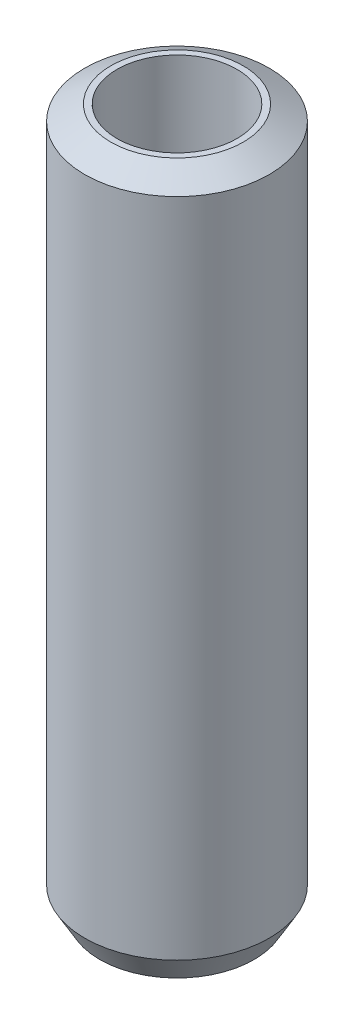
ISO-10303-21;
HEADER;
FILE_DESCRIPTION(('STEP AP214'),'2;1');
FILE_NAME('part.step','',(''),(''),'','','');
FILE_SCHEMA(('AUTOMOTIVE_DESIGN { 1 0 10303 214 1 1 1 1 }'));
ENDSEC;
DATA;
#1=APPLICATION_CONTEXT('core data for automotive mechanical design processes');
#2=APPLICATION_PROTOCOL_DEFINITION('international standard','automotive_design',2000,#1);
#3=PRODUCT_CONTEXT('',#1,'mechanical');
#4=PRODUCT('Part','Part','',(#3));
#5=PRODUCT_RELATED_PRODUCT_CATEGORY('part','',(#4));
#6=PRODUCT_DEFINITION_FORMATION('','',#4);
#7=PRODUCT_DEFINITION_CONTEXT('part definition',#1,'design');
#8=PRODUCT_DEFINITION('design','',#6,#7);
#9=PRODUCT_DEFINITION_SHAPE('','',#8);
#10=(LENGTH_UNIT() NAMED_UNIT(*) SI_UNIT(.MILLI.,.METRE.));
#11=(NAMED_UNIT(*) PLANE_ANGLE_UNIT() SI_UNIT($,.RADIAN.));
#12=(NAMED_UNIT(*) SI_UNIT($,.STERADIAN.) SOLID_ANGLE_UNIT());
#13=UNCERTAINTY_MEASURE_WITH_UNIT(LENGTH_MEASURE(1.E-05),#10,'distance_accuracy_value','');
#14=(GEOMETRIC_REPRESENTATION_CONTEXT(3) GLOBAL_UNCERTAINTY_ASSIGNED_CONTEXT((#13)) GLOBAL_UNIT_ASSIGNED_CONTEXT((#10,
#11,#12)) REPRESENTATION_CONTEXT('',''));
#15=CARTESIAN_POINT('',(0.,0.,0.));
#16=DIRECTION('',(0.,0.,1.));
#17=DIRECTION('',(1.,0.,0.));
#18=AXIS2_PLACEMENT_3D('',#15,#16,#17);
#19=CARTESIAN_POINT('',(0.,247.459883982534,0.));
#20=DIRECTION('',(0.,-1.,0.));
#21=DIRECTION('',(0.,0.,-1.));
#22=AXIS2_PLACEMENT_3D('',#19,#20,#21);
#23=CYLINDRICAL_SURFACE('',#22,32.5);
#24=CARTESIAN_POINT('',(0.,242.16174137972,0.));
#25=DIRECTION('',(0.,1.,0.));
#26=DIRECTION('',(0.,0.,1.));
#27=AXIS2_PLACEMENT_3D('',#24,#25,#26);
#28=CIRCLE('',#27,32.5);
#29=CARTESIAN_POINT('',(0.,242.16174137972,32.5));
#30=VERTEX_POINT('',#29);
#31=EDGE_CURVE('E50',#30,#30,#28,.F.);
#32=ORIENTED_EDGE('',*,*,#31,.T.);
#33=EDGE_LOOP('',(#32));
#34=FACE_BOUND('',#33,.T.);
#35=CARTESIAN_POINT('',(0.,9.17665217381791,0.));
#36=DIRECTION('',(0.,1.,0.));
#37=DIRECTION('',(0.,0.,1.));
#38=AXIS2_PLACEMENT_3D('',#35,#36,#37);
#39=CIRCLE('',#38,32.5);
#40=CARTESIAN_POINT('',(0.,9.17665217381791,32.5));
#41=VERTEX_POINT('',#40);
#42=EDGE_CURVE('E51',#41,#41,#39,.T.);
#43=ORIENTED_EDGE('',*,*,#42,.T.);
#44=EDGE_LOOP('',(#43));
#45=FACE_BOUND('',#44,.T.);
#46=ADVANCED_FACE('F39',(#34,#45),#23,.T.);
#47=CARTESIAN_POINT('',(0.,247.459883982534,0.));
#48=DIRECTION('',(0.,1.,0.));
#49=DIRECTION('',(0.,0.,1.));
#50=AXIS2_PLACEMENT_3D('',#47,#48,#49);
#51=PLANE('',#50);
#52=CARTESIAN_POINT('',(0.,247.459883982534,0.));
#53=DIRECTION('',(0.,1.,0.));
#54=DIRECTION('',(0.,0.,1.));
#55=AXIS2_PLACEMENT_3D('',#52,#53,#54);
#56=CIRCLE('',#55,23.323347826182);
#57=CARTESIAN_POINT('',(0.,247.459883982534,23.323347826182));
#58=VERTEX_POINT('',#57);
#59=EDGE_CURVE('E54',#58,#58,#56,.T.);
#60=ORIENTED_EDGE('',*,*,#59,.T.);
#61=EDGE_LOOP('',(#60));
#62=FACE_BOUND('',#61,.T.);
#63=CARTESIAN_POINT('',(0.,247.459883982534,0.));
#64=DIRECTION('',(0.,1.,0.));
#65=DIRECTION('',(0.,0.,1.));
#66=AXIS2_PLACEMENT_3D('',#63,#64,#65);
#67=CIRCLE('',#66,21.1431721340812);
#68=CARTESIAN_POINT('',(0.,247.459883982534,21.1431721340812));
#69=VERTEX_POINT('',#68);
#70=EDGE_CURVE('E58',#69,#69,#67,.T.);
#71=ORIENTED_EDGE('',*,*,#70,.F.);
#72=EDGE_LOOP('',(#71));
#73=FACE_BOUND('',#72,.T.);
#74=ADVANCED_FACE('F69',(#62,#73),#51,.T.);
#75=CARTESIAN_POINT('',(0.,0.,0.));
#76=DIRECTION('',(0.,1.,0.));
#77=DIRECTION('',(0.,0.,1.));
#78=AXIS2_PLACEMENT_3D('',#75,#76,#77);
#79=PLANE('',#78);
#80=CARTESIAN_POINT('',(0.,0.,0.));
#81=DIRECTION('',(0.,1.,0.));
#82=DIRECTION('',(0.,0.,1.));
#83=AXIS2_PLACEMENT_3D('',#80,#81,#82);
#84=CIRCLE('',#83,27.2018573971866);
#85=CARTESIAN_POINT('',(0.,0.,27.2018573971866));
#86=VERTEX_POINT('',#85);
#87=EDGE_CURVE('E10',#86,#86,#84,.F.);
#88=ORIENTED_EDGE('',*,*,#87,.T.);
#89=EDGE_LOOP('',(#88));
#90=FACE_BOUND('',#89,.T.);
#91=CARTESIAN_POINT('',(0.,0.,0.));
#92=DIRECTION('',(0.,1.,0.));
#93=DIRECTION('',(0.,0.,1.));
#94=AXIS2_PLACEMENT_3D('',#91,#92,#93);
#95=CIRCLE('',#94,21.1431721340812);
#96=CARTESIAN_POINT('',(0.,0.,21.1431721340812));
#97=VERTEX_POINT('',#96);
#98=EDGE_CURVE('E63',#97,#97,#95,.T.);
#99=ORIENTED_EDGE('',*,*,#98,.T.);
#100=EDGE_LOOP('',(#99));
#101=FACE_BOUND('',#100,.T.);
#102=ADVANCED_FACE('F75',(#90,#101),#79,.F.);
#103=CARTESIAN_POINT('',(0.,247.459883982534,0.));
#104=DIRECTION('',(0.,-1.,0.));
#105=DIRECTION('',(0.,0.,-1.));
#106=AXIS2_PLACEMENT_3D('',#103,#104,#105);
#107=CYLINDRICAL_SURFACE('',#106,21.1431721340812);
#108=ORIENTED_EDGE('',*,*,#70,.T.);
#109=EDGE_LOOP('',(#108));
#110=FACE_BOUND('',#109,.T.);
#111=ORIENTED_EDGE('',*,*,#98,.F.);
#112=EDGE_LOOP('',(#111));
#113=FACE_BOUND('',#112,.T.);
#114=ADVANCED_FACE('F70',(#110,#113),#107,.F.);
#115=CARTESIAN_POINT('',(0.,247.459883982534,0.));
#116=DIRECTION('',(0.,-1.,0.));
#117=DIRECTION('',(0.,0.,-1.));
#118=AXIS2_PLACEMENT_3D('',#115,#116,#117);
#119=CONICAL_SURFACE('',#118,23.323347826182,1.0471975511966);
#120=ORIENTED_EDGE('',*,*,#31,.F.);
#121=EDGE_LOOP('',(#120));
#122=FACE_BOUND('',#121,.T.);
#123=ORIENTED_EDGE('',*,*,#59,.F.);
#124=EDGE_LOOP('',(#123));
#125=FACE_BOUND('',#124,.T.);
#126=ADVANCED_FACE('F81',(#122,#125),#119,.T.);
#127=CARTESIAN_POINT('',(0.,9.17665217381791,0.));
#128=DIRECTION('',(0.,1.,0.));
#129=DIRECTION('',(0.,0.,1.));
#130=AXIS2_PLACEMENT_3D('',#127,#128,#129);
#131=CONICAL_SURFACE('',#130,32.5,0.523598775598302);
#132=CARTESIAN_POINT('',(0.,0.,27.2018573971866));
#133=CARTESIAN_POINT('',(0.,0.0955901268106014,27.2570463826326));
#134=CARTESIAN_POINT('',(0.,0.191180253621205,27.3122353680786));
#135=CARTESIAN_POINT('',(0.,0.382360507242411,27.4226133389705));
#136=CARTESIAN_POINT('',(0.,0.477950634053015,27.4778023244165));
#137=CARTESIAN_POINT('',(0.,0.669130887674221,27.5881802953084));
#138=CARTESIAN_POINT('',(0.,0.764721014484824,27.6433692807544));
#139=CARTESIAN_POINT('',(0.,0.955901268106031,27.7537472516464));
#140=CARTESIAN_POINT('',(0.,1.05149139491663,27.8089362370923));
#141=CARTESIAN_POINT('',(0.,1.24267164853784,27.9193142079843));
#142=CARTESIAN_POINT('',(0.,1.33826177534844,27.9745031934302));
#143=CARTESIAN_POINT('',(0.,1.52944202896965,28.0848811643222));
#144=CARTESIAN_POINT('',(0.,1.62503215578025,28.1400701497682));
#145=CARTESIAN_POINT('',(0.,1.81621240940146,28.2504481206601));
#146=CARTESIAN_POINT('',(0.,1.91180253621206,28.3056371061061));
#147=CARTESIAN_POINT('',(0.,2.10298278983327,28.416015076998));
#148=CARTESIAN_POINT('',(0.,2.19857291664387,28.471204062444));
#149=CARTESIAN_POINT('',(0.,2.38975317026508,28.5815820333359));
#150=CARTESIAN_POINT('',(0.,2.48534329707568,28.6367710187819));
#151=CARTESIAN_POINT('',(0.,2.67652355069689,28.7471489896739));
#152=CARTESIAN_POINT('',(0.,2.77211367750749,28.8023379751198));
#153=CARTESIAN_POINT('',(0.,2.9632939311287,28.9127159460118));
#154=CARTESIAN_POINT('',(0.,3.0588840579393,28.9679049314577));
#155=CARTESIAN_POINT('',(0.,3.25006431156051,29.0782829023497));
#156=CARTESIAN_POINT('',(0.,3.34565443837111,29.1334718877957));
#157=CARTESIAN_POINT('',(0.,3.53683469199232,29.2438498586876));
#158=CARTESIAN_POINT('',(0.,3.63242481880292,29.2990388441336));
#159=CARTESIAN_POINT('',(0.,3.82360507242413,29.4094168150255));
#160=CARTESIAN_POINT('',(0.,3.91919519923473,29.4646058004715));
#161=CARTESIAN_POINT('',(0.,4.11037545285594,29.5749837713635));
#162=CARTESIAN_POINT('',(0.,4.20596557966654,29.6301727568094));
#163=CARTESIAN_POINT('',(0.,4.39714583328775,29.7405507277014));
#164=CARTESIAN_POINT('',(0.,4.49273596009835,29.7957397131473));
#165=CARTESIAN_POINT('',(0.,4.68391621371956,29.9061176840393));
#166=CARTESIAN_POINT('',(0.,4.77950634053016,29.9613066694853));
#167=CARTESIAN_POINT('',(0.,4.97068659415137,30.0716846403772));
#168=CARTESIAN_POINT('',(0.,5.06627672096197,30.1268736258232));
#169=CARTESIAN_POINT('',(0.,5.25745697458318,30.2372515967151));
#170=CARTESIAN_POINT('',(0.,5.35304710139378,30.2924405821611));
#171=CARTESIAN_POINT('',(0.,5.54422735501499,30.402818553053));
#172=CARTESIAN_POINT('',(0.,5.63981748182559,30.458007538499));
#173=CARTESIAN_POINT('',(0.,5.8309977354468,30.568385509391));
#174=CARTESIAN_POINT('',(0.,5.9265878622574,30.6235744948369));
#175=CARTESIAN_POINT('',(0.,6.11776811587861,30.7339524657289));
#176=CARTESIAN_POINT('',(0.,6.21335824268921,30.7891414511748));
#177=CARTESIAN_POINT('',(0.,6.40453849631042,30.8995194220668));
#178=CARTESIAN_POINT('',(0.,6.50012862312102,30.9547084075128));
#179=CARTESIAN_POINT('',(0.,6.69130887674223,31.0650863784047));
#180=CARTESIAN_POINT('',(0.,6.78689900355283,31.1202753638507));
#181=CARTESIAN_POINT('',(0.,6.97807925717404,31.2306533347426));
#182=CARTESIAN_POINT('',(0.,7.07366938398464,31.2858423201886));
#183=CARTESIAN_POINT('',(0.,7.26484963760585,31.3962202910805));
#184=CARTESIAN_POINT('',(0.,7.36043976441645,31.4514092765265));
#185=CARTESIAN_POINT('',(0.,7.55162001803766,31.5617872474185));
#186=CARTESIAN_POINT('',(0.,7.64721014484826,31.6169762328644));
#187=CARTESIAN_POINT('',(0.,7.83839039846947,31.7273542037564));
#188=CARTESIAN_POINT('',(0.,7.93398052528007,31.7825431892024));
#189=CARTESIAN_POINT('',(0.,8.12516077890128,31.8929211600943));
#190=CARTESIAN_POINT('',(0.,8.22075090571188,31.9481101455403));
#191=CARTESIAN_POINT('',(0.,8.41193115933309,32.0584881164322));
#192=CARTESIAN_POINT('',(0.,8.50752128614369,32.1136771018782));
#193=CARTESIAN_POINT('',(0.,8.6987015397649,32.2240550727701));
#194=CARTESIAN_POINT('',(0.,8.7942916665755,32.2792440582161));
#195=CARTESIAN_POINT('',(0.,8.98547192019671,32.3896220291081));
#196=CARTESIAN_POINT('',(0.,9.08106204700731,32.444811014554));
#197=CARTESIAN_POINT('',(0.,9.17665217381791,32.5));
#198=B_SPLINE_CURVE_WITH_KNOTS('',3,(#132,#133,#134,#135,#136,#137,#138,#139,#140,#141,#142,
#143,#144,#145,#146,#147,#148,#149,#150,#151,#152,#153,#154,#155,#156,#157,#158,#159,#160,#161,
#162,#163,#164,#165,#166,#167,#168,#169,#170,#171,#172,#173,#174,#175,#176,#177,#178,#179,#180,
#181,#182,#183,#184,#185,#186,#187,#188,#189,#190,#191,#192,#193,#194,#195,#196,#197),
.UNSPECIFIED.,.F.,.F.,(4,2,2,2,2,2,2,2,2,2,2,2,2,2,2,2,2,2,2,2,2,2,2,2,2,2,2,2,2,2,2,2,4),(0.,
0.331133912675834,0.662267825351668,0.993401738027502,1.32453565070334,1.65566956337917,
1.986803476055,2.31793738873084,2.64907130140667,2.98020521408251,3.31133912675834,
3.64247303943417,3.97360695211001,4.30474086478584,4.63587477746168,4.96700869013751,
5.29814260281335,5.62927651548918,5.96041042816501,6.29154434084085,6.62267825351668,
6.95381216619252,7.28494607886835,7.61607999154419,7.94721390422002,8.27834781689586,
8.60948172957169,8.94061564224752,9.27174955492336,9.60288346759919,9.93401738027502,
10.2651512929509,10.5962852056267),.UNSPECIFIED.);
#199=EDGE_CURVE('BSEAM45',#86,#41,#198,.T.);
#200=ORIENTED_EDGE('',*,*,#87,.F.);
#201=ORIENTED_EDGE('',*,*,#42,.F.);
#202=ORIENTED_EDGE('',*,*,#199,.T.);
#203=ORIENTED_EDGE('',*,*,#199,.F.);
#204=EDGE_LOOP('',(#200,#202,#201,#203));
#205=FACE_BOUND('',#204,.T.);
#206=ADVANCED_FACE('F45',(#205),#131,.T.);
#207=CLOSED_SHELL('',(#46,#74,#102,#114,#126,#206));
#208=MANIFOLD_SOLID_BREP('B2',#207);
#209=ADVANCED_BREP_SHAPE_REPRESENTATION('',(#18,#208),#14);
#210=SHAPE_DEFINITION_REPRESENTATION(#9,#209);
ENDSEC;
END-ISO-10303-21;
